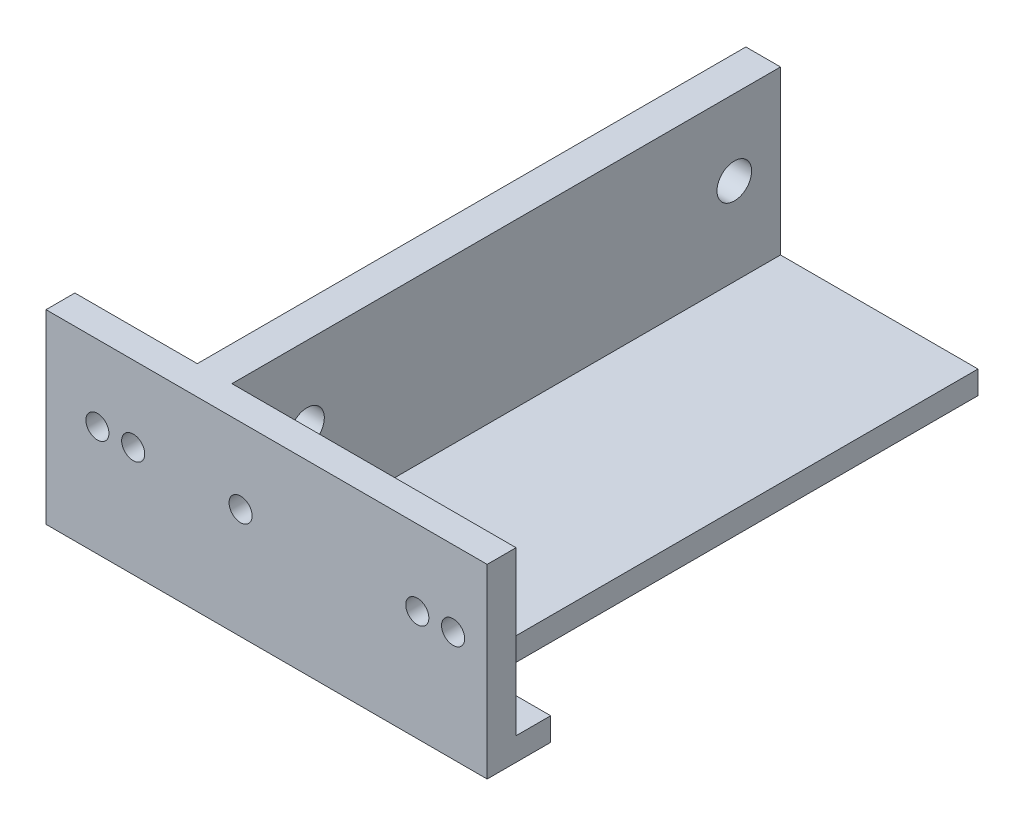
ISO-10303-21;
HEADER;
FILE_DESCRIPTION(('STEP AP214'),'2;1');
FILE_NAME('part.step','',(''),(''),'','','');
FILE_SCHEMA(('AUTOMOTIVE_DESIGN { 1 0 10303 214 1 1 1 1 }'));
ENDSEC;
DATA;
#1=APPLICATION_CONTEXT('core data for automotive mechanical design processes');
#2=APPLICATION_PROTOCOL_DEFINITION('international standard','automotive_design',2000,#1);
#3=PRODUCT_CONTEXT('',#1,'mechanical');
#4=PRODUCT('Part','Part','',(#3));
#5=PRODUCT_RELATED_PRODUCT_CATEGORY('part','',(#4));
#6=PRODUCT_DEFINITION_FORMATION('','',#4);
#7=PRODUCT_DEFINITION_CONTEXT('part definition',#1,'design');
#8=PRODUCT_DEFINITION('design','',#6,#7);
#9=PRODUCT_DEFINITION_SHAPE('','',#8);
#10=(LENGTH_UNIT() NAMED_UNIT(*) SI_UNIT(.MILLI.,.METRE.));
#11=(NAMED_UNIT(*) PLANE_ANGLE_UNIT() SI_UNIT($,.RADIAN.));
#12=(NAMED_UNIT(*) SI_UNIT($,.STERADIAN.) SOLID_ANGLE_UNIT());
#13=UNCERTAINTY_MEASURE_WITH_UNIT(LENGTH_MEASURE(1.E-05),#10,'distance_accuracy_value','');
#14=(GEOMETRIC_REPRESENTATION_CONTEXT(3) GLOBAL_UNCERTAINTY_ASSIGNED_CONTEXT((#13)) GLOBAL_UNIT_ASSIGNED_CONTEXT((#10,
#11,#12)) REPRESENTATION_CONTEXT('',''));
#15=CARTESIAN_POINT('',(0.,0.,0.));
#16=DIRECTION('',(0.,0.,1.));
#17=DIRECTION('',(1.,0.,0.));
#18=AXIS2_PLACEMENT_3D('',#15,#16,#17);
#19=CARTESIAN_POINT('',(3.,0.,0.));
#20=DIRECTION('',(-1.,0.,0.));
#21=DIRECTION('',(0.,0.,1.));
#22=AXIS2_PLACEMENT_3D('',#19,#20,#21);
#23=PLANE('',#22);
#24=CARTESIAN_POINT('',(3.,9.55,-9.));
#25=DIRECTION('',(1.,0.,0.));
#26=DIRECTION('',(0.,0.,-1.));
#27=AXIS2_PLACEMENT_3D('',#24,#25,#26);
#28=CIRCLE('',#27,1.5);
#29=CARTESIAN_POINT('',(3.,9.55,-10.5));
#30=VERTEX_POINT('',#29);
#31=EDGE_CURVE('E288',#30,#30,#28,.T.);
#32=ORIENTED_EDGE('',*,*,#31,.F.);
#33=EDGE_LOOP('',(#32));
#34=FACE_BOUND('',#33,.T.);
#35=CARTESIAN_POINT('',(3.,9.55,-46.));
#36=DIRECTION('',(1.,0.,0.));
#37=DIRECTION('',(0.,0.,-1.));
#38=AXIS2_PLACEMENT_3D('',#35,#36,#37);
#39=CIRCLE('',#38,1.5);
#40=CARTESIAN_POINT('',(3.,9.55,-47.5));
#41=VERTEX_POINT('',#40);
#42=EDGE_CURVE('E294',#41,#41,#39,.T.);
#43=ORIENTED_EDGE('',*,*,#42,.F.);
#44=EDGE_LOOP('',(#43));
#45=FACE_BOUND('',#44,.T.);
#46=DIRECTION('',(0.,0.,1.));
#47=VECTOR('',#46,1.);
#48=CARTESIAN_POINT('',(3.,2.,0.));
#49=LINE('',#48,#47);
#50=CARTESIAN_POINT('',(3.,2.,-50.));
#51=VERTEX_POINT('',#50);
#52=CARTESIAN_POINT('',(3.,2.,-2.5));
#53=VERTEX_POINT('',#52);
#54=EDGE_CURVE('E226',#51,#53,#49,.T.);
#55=ORIENTED_EDGE('',*,*,#54,.F.);
#56=DIRECTION('',(0.,1.,0.));
#57=VECTOR('',#56,1.);
#58=CARTESIAN_POINT('',(3.,0.,-50.));
#59=LINE('',#58,#57);
#60=CARTESIAN_POINT('',(3.,16.1,-50.));
#61=VERTEX_POINT('',#60);
#62=EDGE_CURVE('E164',#51,#61,#59,.T.);
#63=ORIENTED_EDGE('',*,*,#62,.T.);
#64=DIRECTION('',(0.,0.,1.));
#65=VECTOR('',#64,1.);
#66=CARTESIAN_POINT('',(3.,16.1,0.));
#67=LINE('',#66,#65);
#68=CARTESIAN_POINT('',(3.,16.1,-2.5));
#69=VERTEX_POINT('',#68);
#70=EDGE_CURVE('E63',#61,#69,#67,.T.);
#71=ORIENTED_EDGE('',*,*,#70,.T.);
#72=DIRECTION('',(0.,-1.,0.));
#73=VECTOR('',#72,1.);
#74=CARTESIAN_POINT('',(3.,0.,-2.5));
#75=LINE('',#74,#73);
#76=EDGE_CURVE('E285',#69,#53,#75,.T.);
#77=ORIENTED_EDGE('',*,*,#76,.T.);
#78=EDGE_LOOP('',(#55,#63,#71,#77));
#79=FACE_BOUND('',#78,.T.);
#80=ADVANCED_FACE('F39',(#34,#45,#79),#23,.F.);
#81=CARTESIAN_POINT('',(0.,0.,0.));
#82=DIRECTION('',(-1.,0.,0.));
#83=DIRECTION('',(0.,0.,1.));
#84=AXIS2_PLACEMENT_3D('',#81,#82,#83);
#85=PLANE('',#84);
#86=CARTESIAN_POINT('',(0.,9.55,-46.));
#87=DIRECTION('',(1.,0.,0.));
#88=DIRECTION('',(0.,0.,-1.));
#89=AXIS2_PLACEMENT_3D('',#86,#87,#88);
#90=CIRCLE('',#89,1.5);
#91=CARTESIAN_POINT('',(0.,9.55,-47.5));
#92=VERTEX_POINT('',#91);
#93=EDGE_CURVE('E289',#92,#92,#90,.T.);
#94=ORIENTED_EDGE('',*,*,#93,.T.);
#95=EDGE_LOOP('',(#94));
#96=FACE_BOUND('',#95,.T.);
#97=CARTESIAN_POINT('',(0.,9.55,-9.));
#98=DIRECTION('',(1.,0.,0.));
#99=DIRECTION('',(0.,0.,-1.));
#100=AXIS2_PLACEMENT_3D('',#97,#98,#99);
#101=CIRCLE('',#100,1.5);
#102=CARTESIAN_POINT('',(0.,9.55,-10.5));
#103=VERTEX_POINT('',#102);
#104=EDGE_CURVE('E298',#103,#103,#101,.T.);
#105=ORIENTED_EDGE('',*,*,#104,.T.);
#106=EDGE_LOOP('',(#105));
#107=FACE_BOUND('',#106,.T.);
#108=DIRECTION('',(0.,1.,0.));
#109=VECTOR('',#108,1.);
#110=CARTESIAN_POINT('',(0.,0.,-50.));
#111=LINE('',#110,#109);
#112=CARTESIAN_POINT('',(0.,2.,-50.));
#113=VERTEX_POINT('',#112);
#114=CARTESIAN_POINT('',(0.,16.1,-50.));
#115=VERTEX_POINT('',#114);
#116=EDGE_CURVE('E293',#113,#115,#111,.T.);
#117=ORIENTED_EDGE('',*,*,#116,.F.);
#118=DIRECTION('',(0.,0.,1.));
#119=VECTOR('',#118,1.);
#120=CARTESIAN_POINT('',(0.,2.,0.));
#121=LINE('',#120,#119);
#122=CARTESIAN_POINT('',(0.,2.,-2.5));
#123=VERTEX_POINT('',#122);
#124=EDGE_CURVE('E212',#113,#123,#121,.T.);
#125=ORIENTED_EDGE('',*,*,#124,.T.);
#126=DIRECTION('',(0.,-1.,0.));
#127=VECTOR('',#126,1.);
#128=CARTESIAN_POINT('',(0.,0.,-2.5));
#129=LINE('',#128,#127);
#130=CARTESIAN_POINT('',(0.,16.1,-2.5));
#131=VERTEX_POINT('',#130);
#132=EDGE_CURVE('E174',#131,#123,#129,.T.);
#133=ORIENTED_EDGE('',*,*,#132,.F.);
#134=DIRECTION('',(0.,0.,1.));
#135=VECTOR('',#134,1.);
#136=CARTESIAN_POINT('',(0.,16.1,0.));
#137=LINE('',#136,#135);
#138=EDGE_CURVE('E167',#115,#131,#137,.T.);
#139=ORIENTED_EDGE('',*,*,#138,.F.);
#140=EDGE_LOOP('',(#117,#125,#133,#139));
#141=FACE_BOUND('',#140,.T.);
#142=ADVANCED_FACE('F316',(#96,#107,#141),#85,.T.);
#143=CARTESIAN_POINT('',(-10.6,0.,-2.5));
#144=DIRECTION('',(0.,0.,-1.));
#145=DIRECTION('',(-1.,0.,0.));
#146=AXIS2_PLACEMENT_3D('',#143,#144,#145);
#147=PLANE('',#146);
#148=CARTESIAN_POINT('',(-6.14999999999982,9.55000000000008,-2.5));
#149=DIRECTION('',(0.,0.,-1.));
#150=DIRECTION('',(-1.,0.,0.));
#151=AXIS2_PLACEMENT_3D('',#148,#149,#150);
#152=CIRCLE('',#151,1.0000000000001);
#153=CARTESIAN_POINT('',(-7.14999999999992,9.55000000000008,-2.5));
#154=VERTEX_POINT('',#153);
#155=EDGE_CURVE('E230',#154,#154,#152,.T.);
#156=ORIENTED_EDGE('',*,*,#155,.F.);
#157=EDGE_LOOP('',(#156));
#158=FACE_BOUND('',#157,.T.);
#159=CARTESIAN_POINT('',(-3.04999999999986,9.55000000000006,-2.5));
#160=DIRECTION('',(0.,0.,-1.));
#161=DIRECTION('',(-1.,0.,0.));
#162=AXIS2_PLACEMENT_3D('',#159,#160,#161);
#163=CIRCLE('',#162,1.);
#164=CARTESIAN_POINT('',(-4.04999999999986,9.55000000000006,-2.5));
#165=VERTEX_POINT('',#164);
#166=EDGE_CURVE('E240',#165,#165,#163,.T.);
#167=ORIENTED_EDGE('',*,*,#166,.F.);
#168=EDGE_LOOP('',(#167));
#169=FACE_BOUND('',#168,.T.);
#170=ORIENTED_EDGE('',*,*,#132,.T.);
#171=DIRECTION('',(1.,0.,0.));
#172=VECTOR('',#171,1.);
#173=CARTESIAN_POINT('',(38.4,2.,-2.5));
#174=LINE('',#173,#172);
#175=CARTESIAN_POINT('',(-10.6,2.,-2.5));
#176=VERTEX_POINT('',#175);
#177=EDGE_CURVE('E214',#176,#123,#174,.T.);
#178=ORIENTED_EDGE('',*,*,#177,.F.);
#179=DIRECTION('',(0.,1.,0.));
#180=VECTOR('',#179,1.);
#181=CARTESIAN_POINT('',(-10.6,0.,-2.5));
#182=LINE('',#181,#180);
#183=CARTESIAN_POINT('',(-10.6,16.1,-2.5));
#184=VERTEX_POINT('',#183);
#185=EDGE_CURVE('E276',#176,#184,#182,.T.);
#186=ORIENTED_EDGE('',*,*,#185,.T.);
#187=DIRECTION('',(1.,0.,0.));
#188=VECTOR('',#187,1.);
#189=CARTESIAN_POINT('',(-10.6,16.1,-2.5));
#190=LINE('',#189,#188);
#191=EDGE_CURVE('E282',#184,#131,#190,.T.);
#192=ORIENTED_EDGE('',*,*,#191,.T.);
#193=EDGE_LOOP('',(#170,#178,#186,#192));
#194=FACE_BOUND('',#193,.T.);
#195=ADVANCED_FACE('F319',(#158,#169,#194),#147,.T.);
#196=DIRECTION('',(0.,1.,0.));
#197=VECTOR('',#196,1.);
#198=CARTESIAN_POINT('',(27.6,0.,-2.5));
#199=LINE('',#198,#197);
#200=CARTESIAN_POINT('',(27.6,2.,-2.5));
#201=VERTEX_POINT('',#200);
#202=CARTESIAN_POINT('',(27.6,16.1,-2.5));
#203=VERTEX_POINT('',#202);
#204=EDGE_CURVE('E134',#201,#203,#199,.T.);
#205=ORIENTED_EDGE('',*,*,#204,.F.);
#206=EDGE_CURVE('E199',#53,#201,#174,.T.);
#207=ORIENTED_EDGE('',*,*,#206,.F.);
#208=ORIENTED_EDGE('',*,*,#76,.F.);
#209=EDGE_CURVE('E281',#69,#203,#190,.T.);
#210=ORIENTED_EDGE('',*,*,#209,.T.);
#211=EDGE_LOOP('',(#205,#207,#208,#210));
#212=FACE_BOUND('',#211,.T.);
#213=CARTESIAN_POINT('',(24.65,9.54999999999998,-2.5));
#214=DIRECTION('',(0.,0.,-1.));
#215=DIRECTION('',(-1.,0.,0.));
#216=AXIS2_PLACEMENT_3D('',#213,#214,#215);
#217=CIRCLE('',#216,0.999999999999998);
#218=CARTESIAN_POINT('',(23.65,9.54999999999998,-2.5));
#219=VERTEX_POINT('',#218);
#220=EDGE_CURVE('E229',#219,#219,#217,.T.);
#221=ORIENTED_EDGE('',*,*,#220,.F.);
#222=EDGE_LOOP('',(#221));
#223=FACE_BOUND('',#222,.T.);
#224=CARTESIAN_POINT('',(6.25,9.55,-2.5));
#225=DIRECTION('',(0.,0.,-1.));
#226=DIRECTION('',(-1.,0.,0.));
#227=AXIS2_PLACEMENT_3D('',#224,#225,#226);
#228=CIRCLE('',#227,1.);
#229=CARTESIAN_POINT('',(5.25,9.55,-2.5));
#230=VERTEX_POINT('',#229);
#231=EDGE_CURVE('E236',#230,#230,#228,.T.);
#232=ORIENTED_EDGE('',*,*,#231,.F.);
#233=EDGE_LOOP('',(#232));
#234=FACE_BOUND('',#233,.T.);
#235=CARTESIAN_POINT('',(21.55,9.55,-2.5));
#236=DIRECTION('',(0.,0.,-1.));
#237=DIRECTION('',(-1.,0.,0.));
#238=AXIS2_PLACEMENT_3D('',#235,#236,#237);
#239=CIRCLE('',#238,0.999999999999998);
#240=CARTESIAN_POINT('',(20.55,9.55,-2.5));
#241=VERTEX_POINT('',#240);
#242=EDGE_CURVE('E235',#241,#241,#239,.T.);
#243=ORIENTED_EDGE('',*,*,#242,.F.);
#244=EDGE_LOOP('',(#243));
#245=FACE_BOUND('',#244,.T.);
#246=ADVANCED_FACE('F341',(#212,#223,#234,#245),#147,.T.);
#247=CARTESIAN_POINT('',(3.,0.,0.));
#248=DIRECTION('',(0.,0.,-1.));
#249=DIRECTION('',(-1.,0.,0.));
#250=AXIS2_PLACEMENT_3D('',#247,#248,#249);
#251=PLANE('',#250);
#252=CARTESIAN_POINT('',(-6.14999999999982,9.55000000000008,0.));
#253=DIRECTION('',(0.,0.,-1.));
#254=DIRECTION('',(-1.,0.,0.));
#255=AXIS2_PLACEMENT_3D('',#252,#253,#254);
#256=CIRCLE('',#255,1.0000000000001);
#257=CARTESIAN_POINT('',(-7.14999999999992,9.55000000000008,0.));
#258=VERTEX_POINT('',#257);
#259=EDGE_CURVE('E265',#258,#258,#256,.T.);
#260=ORIENTED_EDGE('',*,*,#259,.T.);
#261=EDGE_LOOP('',(#260));
#262=FACE_BOUND('',#261,.T.);
#263=CARTESIAN_POINT('',(24.65,9.54999999999998,0.));
#264=DIRECTION('',(0.,0.,-1.));
#265=DIRECTION('',(-1.,0.,0.));
#266=AXIS2_PLACEMENT_3D('',#263,#264,#265);
#267=CIRCLE('',#266,0.999999999999998);
#268=CARTESIAN_POINT('',(23.65,9.54999999999998,0.));
#269=VERTEX_POINT('',#268);
#270=EDGE_CURVE('E257',#269,#269,#267,.T.);
#271=ORIENTED_EDGE('',*,*,#270,.T.);
#272=EDGE_LOOP('',(#271));
#273=FACE_BOUND('',#272,.T.);
#274=CARTESIAN_POINT('',(6.25,9.55,0.));
#275=DIRECTION('',(0.,0.,-1.));
#276=DIRECTION('',(-1.,0.,0.));
#277=AXIS2_PLACEMENT_3D('',#274,#275,#276);
#278=CIRCLE('',#277,1.);
#279=CARTESIAN_POINT('',(5.25,9.55,0.));
#280=VERTEX_POINT('',#279);
#281=EDGE_CURVE('E253',#280,#280,#278,.T.);
#282=ORIENTED_EDGE('',*,*,#281,.T.);
#283=EDGE_LOOP('',(#282));
#284=FACE_BOUND('',#283,.T.);
#285=CARTESIAN_POINT('',(-3.04999999999986,9.55000000000006,0.));
#286=DIRECTION('',(0.,0.,-1.));
#287=DIRECTION('',(-1.,0.,0.));
#288=AXIS2_PLACEMENT_3D('',#285,#286,#287);
#289=CIRCLE('',#288,1.);
#290=CARTESIAN_POINT('',(-4.04999999999986,9.55000000000006,0.));
#291=VERTEX_POINT('',#290);
#292=EDGE_CURVE('E261',#291,#291,#289,.T.);
#293=ORIENTED_EDGE('',*,*,#292,.T.);
#294=EDGE_LOOP('',(#293));
#295=FACE_BOUND('',#294,.T.);
#296=CARTESIAN_POINT('',(21.55,9.55,0.));
#297=DIRECTION('',(0.,0.,-1.));
#298=DIRECTION('',(-1.,0.,0.));
#299=AXIS2_PLACEMENT_3D('',#296,#297,#298);
#300=CIRCLE('',#299,0.999999999999998);
#301=CARTESIAN_POINT('',(20.55,9.55,0.));
#302=VERTEX_POINT('',#301);
#303=EDGE_CURVE('E234',#302,#302,#300,.T.);
#304=ORIENTED_EDGE('',*,*,#303,.T.);
#305=EDGE_LOOP('',(#304));
#306=FACE_BOUND('',#305,.T.);
#307=DIRECTION('',(-1.,0.,0.));
#308=VECTOR('',#307,1.);
#309=CARTESIAN_POINT('',(3.,0.,0.));
#310=LINE('',#309,#308);
#311=CARTESIAN_POINT('',(27.6,0.,0.));
#312=VERTEX_POINT('',#311);
#313=CARTESIAN_POINT('',(-10.6,0.,0.));
#314=VERTEX_POINT('',#313);
#315=EDGE_CURVE('E147',#312,#314,#310,.T.);
#316=ORIENTED_EDGE('',*,*,#315,.F.);
#317=DIRECTION('',(0.,1.,0.));
#318=VECTOR('',#317,1.);
#319=CARTESIAN_POINT('',(27.6,0.,0.));
#320=LINE('',#319,#318);
#321=CARTESIAN_POINT('',(27.6,16.1,0.));
#322=VERTEX_POINT('',#321);
#323=EDGE_CURVE('E131',#312,#322,#320,.T.);
#324=ORIENTED_EDGE('',*,*,#323,.T.);
#325=DIRECTION('',(-1.,0.,0.));
#326=VECTOR('',#325,1.);
#327=CARTESIAN_POINT('',(3.,16.1,0.));
#328=LINE('',#327,#326);
#329=CARTESIAN_POINT('',(-10.6,16.1,0.));
#330=VERTEX_POINT('',#329);
#331=EDGE_CURVE('E145',#322,#330,#328,.T.);
#332=ORIENTED_EDGE('',*,*,#331,.T.);
#333=DIRECTION('',(0.,-1.,0.));
#334=VECTOR('',#333,1.);
#335=CARTESIAN_POINT('',(-10.6,0.,0.));
#336=LINE('',#335,#334);
#337=EDGE_CURVE('E269',#330,#314,#336,.T.);
#338=ORIENTED_EDGE('',*,*,#337,.T.);
#339=EDGE_LOOP('',(#316,#324,#332,#338));
#340=FACE_BOUND('',#339,.T.);
#341=ADVANCED_FACE('F41',(#262,#273,#284,#295,#306,#340),#251,.F.);
#342=CARTESIAN_POINT('',(3.,0.,0.));
#343=DIRECTION('',(0.,1.,0.));
#344=DIRECTION('',(0.,0.,1.));
#345=AXIS2_PLACEMENT_3D('',#342,#343,#344);
#346=PLANE('',#345);
#347=DIRECTION('',(-1.,0.,0.));
#348=VECTOR('',#347,1.);
#349=CARTESIAN_POINT('',(3.,0.,-50.));
#350=LINE('',#349,#348);
#351=CARTESIAN_POINT('',(20.1,0.,-50.));
#352=VERTEX_POINT('',#351);
#353=CARTESIAN_POINT('',(-10.6,0.,-50.));
#354=VERTEX_POINT('',#353);
#355=EDGE_CURVE('E162',#352,#354,#350,.T.);
#356=ORIENTED_EDGE('',*,*,#355,.F.);
#357=DIRECTION('',(0.,0.,1.));
#358=VECTOR('',#357,1.);
#359=CARTESIAN_POINT('',(20.1,0.,-5.5));
#360=LINE('',#359,#358);
#361=CARTESIAN_POINT('',(20.1,0.,-5.5));
#362=VERTEX_POINT('',#361);
#363=EDGE_CURVE('E203',#352,#362,#360,.T.);
#364=ORIENTED_EDGE('',*,*,#363,.T.);
#365=DIRECTION('',(1.,0.,0.));
#366=VECTOR('',#365,1.);
#367=CARTESIAN_POINT('',(27.6,0.,-5.5));
#368=LINE('',#367,#366);
#369=CARTESIAN_POINT('',(27.6,0.,-5.5));
#370=VERTEX_POINT('',#369);
#371=EDGE_CURVE('E140',#362,#370,#368,.T.);
#372=ORIENTED_EDGE('',*,*,#371,.T.);
#373=DIRECTION('',(0.,0.,1.));
#374=VECTOR('',#373,1.);
#375=CARTESIAN_POINT('',(27.6,0.,0.));
#376=LINE('',#375,#374);
#377=EDGE_CURVE('E329',#370,#312,#376,.T.);
#378=ORIENTED_EDGE('',*,*,#377,.T.);
#379=ORIENTED_EDGE('',*,*,#315,.T.);
#380=DIRECTION('',(0.,0.,-1.));
#381=VECTOR('',#380,1.);
#382=CARTESIAN_POINT('',(-10.6,0.,0.));
#383=LINE('',#382,#381);
#384=EDGE_CURVE('E272',#314,#354,#383,.T.);
#385=ORIENTED_EDGE('',*,*,#384,.T.);
#386=EDGE_LOOP('',(#356,#364,#372,#378,#379,#385));
#387=FACE_BOUND('',#386,.T.);
#388=ADVANCED_FACE('F328',(#387),#346,.F.);
#389=CARTESIAN_POINT('',(3.,0.,-50.));
#390=DIRECTION('',(0.,0.,1.));
#391=DIRECTION('',(1.,0.,0.));
#392=AXIS2_PLACEMENT_3D('',#389,#390,#391);
#393=PLANE('',#392);
#394=DIRECTION('',(-1.,0.,0.));
#395=VECTOR('',#394,1.);
#396=CARTESIAN_POINT('',(38.4,2.,-50.));
#397=LINE('',#396,#395);
#398=CARTESIAN_POINT('',(20.1,2.,-50.));
#399=VERTEX_POINT('',#398);
#400=EDGE_CURVE('E213',#399,#51,#397,.T.);
#401=ORIENTED_EDGE('',*,*,#400,.F.);
#402=DIRECTION('',(0.,1.,0.));
#403=VECTOR('',#402,1.);
#404=CARTESIAN_POINT('',(20.1,0.,-50.));
#405=LINE('',#404,#403);
#406=EDGE_CURVE('E149',#352,#399,#405,.T.);
#407=ORIENTED_EDGE('',*,*,#406,.F.);
#408=ORIENTED_EDGE('',*,*,#355,.T.);
#409=DIRECTION('',(0.,-1.,0.));
#410=VECTOR('',#409,1.);
#411=CARTESIAN_POINT('',(-10.6,0.,-50.));
#412=LINE('',#411,#410);
#413=CARTESIAN_POINT('',(-10.6,2.,-50.));
#414=VERTEX_POINT('',#413);
#415=EDGE_CURVE('E208',#414,#354,#412,.T.);
#416=ORIENTED_EDGE('',*,*,#415,.F.);
#417=EDGE_CURVE('E220',#113,#414,#397,.T.);
#418=ORIENTED_EDGE('',*,*,#417,.F.);
#419=ORIENTED_EDGE('',*,*,#116,.T.);
#420=DIRECTION('',(-1.,0.,0.));
#421=VECTOR('',#420,1.);
#422=CARTESIAN_POINT('',(3.,16.1,-50.));
#423=LINE('',#422,#421);
#424=EDGE_CURVE('E157',#61,#115,#423,.T.);
#425=ORIENTED_EDGE('',*,*,#424,.F.);
#426=ORIENTED_EDGE('',*,*,#62,.F.);
#427=EDGE_LOOP('',(#401,#407,#408,#416,#418,#419,#425,#426));
#428=FACE_BOUND('',#427,.T.);
#429=ADVANCED_FACE('F336',(#428),#393,.F.);
#430=CARTESIAN_POINT('',(3.,16.1,0.));
#431=DIRECTION('',(0.,-1.,0.));
#432=DIRECTION('',(0.,0.,-1.));
#433=AXIS2_PLACEMENT_3D('',#430,#431,#432);
#434=PLANE('',#433);
#435=ORIENTED_EDGE('',*,*,#331,.F.);
#436=DIRECTION('',(0.,0.,1.));
#437=VECTOR('',#436,1.);
#438=CARTESIAN_POINT('',(27.6,16.1,0.));
#439=LINE('',#438,#437);
#440=EDGE_CURVE('E128',#203,#322,#439,.T.);
#441=ORIENTED_EDGE('',*,*,#440,.F.);
#442=ORIENTED_EDGE('',*,*,#209,.F.);
#443=ORIENTED_EDGE('',*,*,#70,.F.);
#444=ORIENTED_EDGE('',*,*,#424,.T.);
#445=ORIENTED_EDGE('',*,*,#138,.T.);
#446=ORIENTED_EDGE('',*,*,#191,.F.);
#447=DIRECTION('',(0.,0.,1.));
#448=VECTOR('',#447,1.);
#449=CARTESIAN_POINT('',(-10.6,16.1,0.));
#450=LINE('',#449,#448);
#451=EDGE_CURVE('E155',#184,#330,#450,.T.);
#452=ORIENTED_EDGE('',*,*,#451,.T.);
#453=EDGE_LOOP('',(#435,#441,#442,#443,#444,#445,#446,#452));
#454=FACE_BOUND('',#453,.T.);
#455=ADVANCED_FACE('F152',(#454),#434,.F.);
#456=CARTESIAN_POINT('',(0.,9.55,-9.));
#457=DIRECTION('',(1.,0.,0.));
#458=DIRECTION('',(0.,0.,-1.));
#459=AXIS2_PLACEMENT_3D('',#456,#457,#458);
#460=CYLINDRICAL_SURFACE('',#459,1.5);
#461=ORIENTED_EDGE('',*,*,#104,.F.);
#462=EDGE_LOOP('',(#461));
#463=FACE_BOUND('',#462,.T.);
#464=ORIENTED_EDGE('',*,*,#31,.T.);
#465=EDGE_LOOP('',(#464));
#466=FACE_BOUND('',#465,.T.);
#467=ADVANCED_FACE('F368',(#463,#466),#460,.F.);
#468=CARTESIAN_POINT('',(0.,9.55,-46.));
#469=DIRECTION('',(1.,0.,0.));
#470=DIRECTION('',(0.,0.,-1.));
#471=AXIS2_PLACEMENT_3D('',#468,#469,#470);
#472=CYLINDRICAL_SURFACE('',#471,1.5);
#473=ORIENTED_EDGE('',*,*,#93,.F.);
#474=EDGE_LOOP('',(#473));
#475=FACE_BOUND('',#474,.T.);
#476=ORIENTED_EDGE('',*,*,#42,.T.);
#477=EDGE_LOOP('',(#476));
#478=FACE_BOUND('',#477,.T.);
#479=ADVANCED_FACE('F405',(#475,#478),#472,.F.);
#480=CARTESIAN_POINT('',(-10.6,0.,0.));
#481=DIRECTION('',(-1.,0.,0.));
#482=DIRECTION('',(0.,0.,1.));
#483=AXIS2_PLACEMENT_3D('',#480,#481,#482);
#484=PLANE('',#483);
#485=ORIENTED_EDGE('',*,*,#337,.F.);
#486=ORIENTED_EDGE('',*,*,#451,.F.);
#487=ORIENTED_EDGE('',*,*,#185,.F.);
#488=DIRECTION('',(0.,0.,1.));
#489=VECTOR('',#488,1.);
#490=CARTESIAN_POINT('',(-10.6,2.,-99.0407993409569));
#491=LINE('',#490,#489);
#492=EDGE_CURVE('E217',#414,#176,#491,.T.);
#493=ORIENTED_EDGE('',*,*,#492,.F.);
#494=ORIENTED_EDGE('',*,*,#415,.T.);
#495=ORIENTED_EDGE('',*,*,#384,.F.);
#496=EDGE_LOOP('',(#485,#486,#487,#493,#494,#495));
#497=FACE_BOUND('',#496,.T.);
#498=ADVANCED_FACE('F323',(#497),#484,.T.);
#499=CARTESIAN_POINT('',(21.55,9.55,42.5));
#500=DIRECTION('',(0.,0.,-1.));
#501=DIRECTION('',(-1.,0.,0.));
#502=AXIS2_PLACEMENT_3D('',#499,#500,#501);
#503=CYLINDRICAL_SURFACE('',#502,0.999999999999998);
#504=ORIENTED_EDGE('',*,*,#242,.T.);
#505=EDGE_LOOP('',(#504));
#506=FACE_BOUND('',#505,.T.);
#507=ORIENTED_EDGE('',*,*,#303,.F.);
#508=EDGE_LOOP('',(#507));
#509=FACE_BOUND('',#508,.T.);
#510=ADVANCED_FACE('F393',(#506,#509),#503,.F.);
#511=CARTESIAN_POINT('',(6.25,9.55,42.5));
#512=DIRECTION('',(0.,0.,-1.));
#513=DIRECTION('',(-1.,0.,0.));
#514=AXIS2_PLACEMENT_3D('',#511,#512,#513);
#515=CYLINDRICAL_SURFACE('',#514,1.);
#516=ORIENTED_EDGE('',*,*,#231,.T.);
#517=EDGE_LOOP('',(#516));
#518=FACE_BOUND('',#517,.T.);
#519=ORIENTED_EDGE('',*,*,#281,.F.);
#520=EDGE_LOOP('',(#519));
#521=FACE_BOUND('',#520,.T.);
#522=ADVANCED_FACE('F395',(#518,#521),#515,.F.);
#523=CARTESIAN_POINT('',(24.65,9.54999999999998,42.5));
#524=DIRECTION('',(0.,0.,-1.));
#525=DIRECTION('',(-1.,0.,0.));
#526=AXIS2_PLACEMENT_3D('',#523,#524,#525);
#527=CYLINDRICAL_SURFACE('',#526,0.999999999999998);
#528=ORIENTED_EDGE('',*,*,#220,.T.);
#529=EDGE_LOOP('',(#528));
#530=FACE_BOUND('',#529,.T.);
#531=ORIENTED_EDGE('',*,*,#270,.F.);
#532=EDGE_LOOP('',(#531));
#533=FACE_BOUND('',#532,.T.);
#534=ADVANCED_FACE('F402',(#530,#533),#527,.F.);
#535=CARTESIAN_POINT('',(-3.04999999999986,9.55000000000006,42.5));
#536=DIRECTION('',(0.,0.,-1.));
#537=DIRECTION('',(-1.,0.,0.));
#538=AXIS2_PLACEMENT_3D('',#535,#536,#537);
#539=CYLINDRICAL_SURFACE('',#538,1.);
#540=ORIENTED_EDGE('',*,*,#166,.T.);
#541=EDGE_LOOP('',(#540));
#542=FACE_BOUND('',#541,.T.);
#543=ORIENTED_EDGE('',*,*,#292,.F.);
#544=EDGE_LOOP('',(#543));
#545=FACE_BOUND('',#544,.T.);
#546=ADVANCED_FACE('F409',(#542,#545),#539,.F.);
#547=CARTESIAN_POINT('',(-6.14999999999982,9.55000000000008,42.5));
#548=DIRECTION('',(0.,0.,-1.));
#549=DIRECTION('',(-1.,0.,0.));
#550=AXIS2_PLACEMENT_3D('',#547,#548,#549);
#551=CYLINDRICAL_SURFACE('',#550,1.0000000000001);
#552=ORIENTED_EDGE('',*,*,#155,.T.);
#553=EDGE_LOOP('',(#552));
#554=FACE_BOUND('',#553,.T.);
#555=ORIENTED_EDGE('',*,*,#259,.F.);
#556=EDGE_LOOP('',(#555));
#557=FACE_BOUND('',#556,.T.);
#558=ADVANCED_FACE('F355',(#554,#557),#551,.F.);
#559=CARTESIAN_POINT('',(38.4,2.,-99.0407993409569));
#560=DIRECTION('',(0.,-1.,0.));
#561=DIRECTION('',(0.,0.,-1.));
#562=AXIS2_PLACEMENT_3D('',#559,#560,#561);
#563=PLANE('',#562);
#564=DIRECTION('',(-1.,0.,0.));
#565=VECTOR('',#564,1.);
#566=CARTESIAN_POINT('',(38.4,2.,-5.50000000000001));
#567=LINE('',#566,#565);
#568=CARTESIAN_POINT('',(27.6,2.,-5.49999999999999));
#569=VERTEX_POINT('',#568);
#570=CARTESIAN_POINT('',(20.1,2.,-5.5));
#571=VERTEX_POINT('',#570);
#572=EDGE_CURVE('E48',#569,#571,#567,.T.);
#573=ORIENTED_EDGE('',*,*,#572,.T.);
#574=DIRECTION('',(0.,0.,-1.));
#575=VECTOR('',#574,1.);
#576=CARTESIAN_POINT('',(20.1,2.,-99.0407993409569));
#577=LINE('',#576,#575);
#578=EDGE_CURVE('E11',#571,#399,#577,.T.);
#579=ORIENTED_EDGE('',*,*,#578,.T.);
#580=ORIENTED_EDGE('',*,*,#400,.T.);
#581=ORIENTED_EDGE('',*,*,#54,.T.);
#582=ORIENTED_EDGE('',*,*,#206,.T.);
#583=DIRECTION('',(0.,0.,-1.));
#584=VECTOR('',#583,1.);
#585=CARTESIAN_POINT('',(27.6,2.,-99.0407993409569));
#586=LINE('',#585,#584);
#587=EDGE_CURVE('E178',#201,#569,#586,.T.);
#588=ORIENTED_EDGE('',*,*,#587,.T.);
#589=EDGE_LOOP('',(#573,#579,#580,#581,#582,#588));
#590=FACE_BOUND('',#589,.T.);
#591=ADVANCED_FACE('F184',(#590),#563,.F.);
#592=ORIENTED_EDGE('',*,*,#124,.F.);
#593=ORIENTED_EDGE('',*,*,#417,.T.);
#594=ORIENTED_EDGE('',*,*,#492,.T.);
#595=ORIENTED_EDGE('',*,*,#177,.T.);
#596=EDGE_LOOP('',(#592,#593,#594,#595));
#597=FACE_BOUND('',#596,.T.);
#598=ADVANCED_FACE('F347',(#597),#563,.F.);
#599=CARTESIAN_POINT('',(27.6,0.,-5.5));
#600=DIRECTION('',(0.,0.,1.));
#601=DIRECTION('',(1.,0.,0.));
#602=AXIS2_PLACEMENT_3D('',#599,#600,#601);
#603=PLANE('',#602);
#604=DIRECTION('',(0.,1.,0.));
#605=VECTOR('',#604,1.);
#606=CARTESIAN_POINT('',(27.6,0.,-5.5));
#607=LINE('',#606,#605);
#608=EDGE_CURVE('E55',#370,#569,#607,.T.);
#609=ORIENTED_EDGE('',*,*,#608,.F.);
#610=ORIENTED_EDGE('',*,*,#371,.F.);
#611=DIRECTION('',(0.,1.,0.));
#612=VECTOR('',#611,1.);
#613=CARTESIAN_POINT('',(20.1,0.,-5.5));
#614=LINE('',#613,#612);
#615=EDGE_CURVE('E191',#362,#571,#614,.T.);
#616=ORIENTED_EDGE('',*,*,#615,.T.);
#617=ORIENTED_EDGE('',*,*,#572,.F.);
#618=EDGE_LOOP('',(#609,#610,#616,#617));
#619=FACE_BOUND('',#618,.T.);
#620=ADVANCED_FACE('F189',(#619),#603,.F.);
#621=CARTESIAN_POINT('',(20.1,0.,-5.5));
#622=DIRECTION('',(-1.,0.,0.));
#623=DIRECTION('',(0.,0.,1.));
#624=AXIS2_PLACEMENT_3D('',#621,#622,#623);
#625=PLANE('',#624);
#626=ORIENTED_EDGE('',*,*,#615,.F.);
#627=ORIENTED_EDGE('',*,*,#363,.F.);
#628=ORIENTED_EDGE('',*,*,#406,.T.);
#629=ORIENTED_EDGE('',*,*,#578,.F.);
#630=EDGE_LOOP('',(#626,#627,#628,#629));
#631=FACE_BOUND('',#630,.T.);
#632=ADVANCED_FACE('F335',(#631),#625,.F.);
#633=CARTESIAN_POINT('',(27.6,0.,0.));
#634=DIRECTION('',(-1.,0.,0.));
#635=DIRECTION('',(0.,0.,1.));
#636=AXIS2_PLACEMENT_3D('',#633,#634,#635);
#637=PLANE('',#636);
#638=ORIENTED_EDGE('',*,*,#204,.T.);
#639=ORIENTED_EDGE('',*,*,#440,.T.);
#640=ORIENTED_EDGE('',*,*,#323,.F.);
#641=ORIENTED_EDGE('',*,*,#377,.F.);
#642=ORIENTED_EDGE('',*,*,#608,.T.);
#643=ORIENTED_EDGE('',*,*,#587,.F.);
#644=EDGE_LOOP('',(#638,#639,#640,#641,#642,#643));
#645=FACE_BOUND('',#644,.T.);
#646=ADVANCED_FACE('F130',(#645),#637,.F.);
#647=CLOSED_SHELL('',(#80,#142,#195,#246,#341,#388,#429,#455,#467,#479,#498,#510,#522,#534,#546,
#558,#591,#598,#620,#632,#646));
#648=MANIFOLD_SOLID_BREP('B2',#647);
#649=ADVANCED_BREP_SHAPE_REPRESENTATION('',(#18,#648),#14);
#650=SHAPE_DEFINITION_REPRESENTATION(#9,#649);
ENDSEC;
END-ISO-10303-21;
